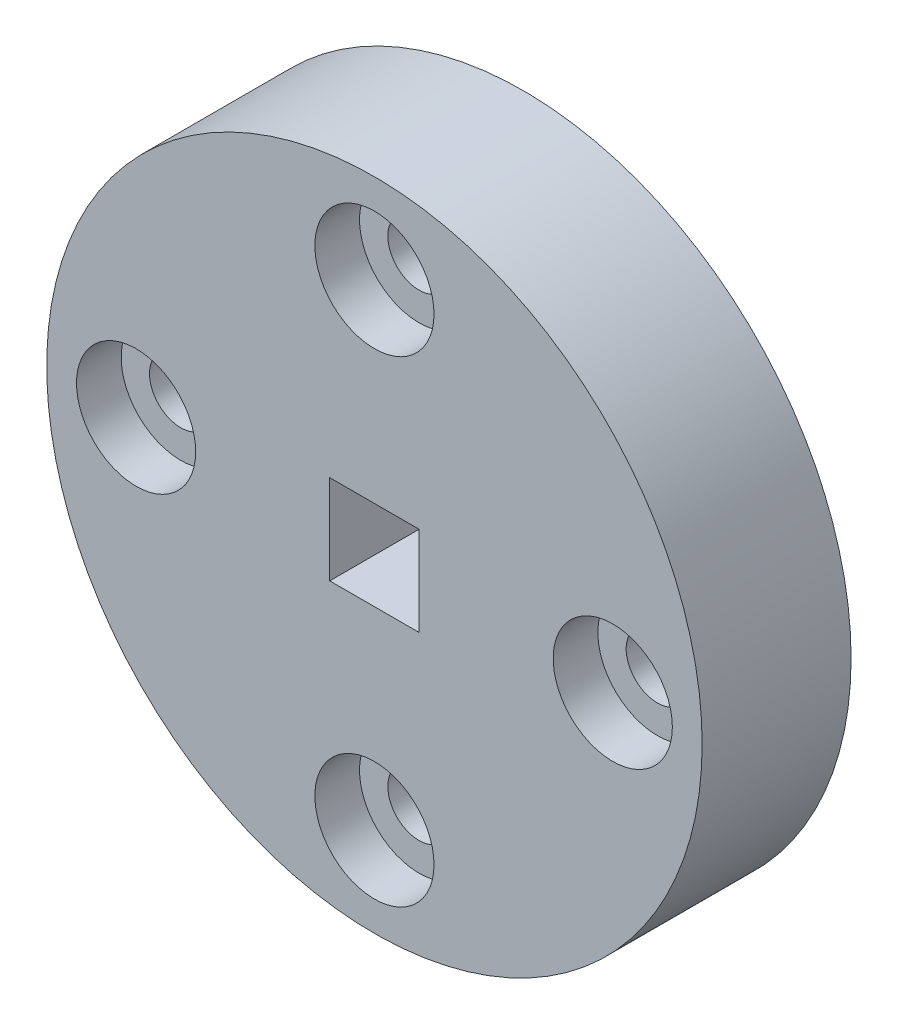
ISO-10303-21;
HEADER;
FILE_DESCRIPTION(('STEP AP214'),'2;1');
FILE_NAME('part.step','',(''),(''),'','','');
FILE_SCHEMA(('AUTOMOTIVE_DESIGN { 1 0 10303 214 1 1 1 1 }'));
ENDSEC;
DATA;
#1=APPLICATION_CONTEXT('core data for automotive mechanical design processes');
#2=APPLICATION_PROTOCOL_DEFINITION('international standard','automotive_design',2000,#1);
#3=PRODUCT_CONTEXT('',#1,'mechanical');
#4=PRODUCT('Part','Part','',(#3));
#5=PRODUCT_RELATED_PRODUCT_CATEGORY('part','',(#4));
#6=PRODUCT_DEFINITION_FORMATION('','',#4);
#7=PRODUCT_DEFINITION_CONTEXT('part definition',#1,'design');
#8=PRODUCT_DEFINITION('design','',#6,#7);
#9=PRODUCT_DEFINITION_SHAPE('','',#8);
#10=(LENGTH_UNIT() NAMED_UNIT(*) SI_UNIT(.MILLI.,.METRE.));
#11=(NAMED_UNIT(*) PLANE_ANGLE_UNIT() SI_UNIT($,.RADIAN.));
#12=(NAMED_UNIT(*) SI_UNIT($,.STERADIAN.) SOLID_ANGLE_UNIT());
#13=UNCERTAINTY_MEASURE_WITH_UNIT(LENGTH_MEASURE(1.E-05),#10,'distance_accuracy_value','');
#14=(GEOMETRIC_REPRESENTATION_CONTEXT(3) GLOBAL_UNCERTAINTY_ASSIGNED_CONTEXT((#13)) GLOBAL_UNIT_ASSIGNED_CONTEXT((#10,
#11,#12)) REPRESENTATION_CONTEXT('',''));
#15=CARTESIAN_POINT('',(0.,0.,0.));
#16=DIRECTION('',(0.,0.,1.));
#17=DIRECTION('',(1.,0.,0.));
#18=AXIS2_PLACEMENT_3D('',#15,#16,#17);
#19=CARTESIAN_POINT('',(5.01808960703953E-07,4.98051479615527E-07,5.));
#20=DIRECTION('',(0.,0.,1.));
#21=DIRECTION('',(1.,0.,0.));
#22=AXIS2_PLACEMENT_3D('',#19,#20,#21);
#23=PLANE('',#22);
#24=CARTESIAN_POINT('',(8.00000049700206,4.97733507187625E-07,5.));
#25=DIRECTION('',(0.,0.,1.));
#26=DIRECTION('',(1.,0.,0.));
#27=AXIS2_PLACEMENT_3D('',#24,#25,#26);
#28=CIRCLE('',#27,2.);
#29=CARTESIAN_POINT('',(10.0000004970021,4.97733507187625E-07,5.));
#30=VERTEX_POINT('',#29);
#31=EDGE_CURVE('E108',#30,#30,#28,.T.);
#32=ORIENTED_EDGE('',*,*,#31,.F.);
#33=EDGE_LOOP('',(#32));
#34=FACE_BOUND('',#33,.T.);
#35=CARTESIAN_POINT('',(4.97002383692546E-07,-7.99999950226649,5.));
#36=DIRECTION('',(0.,0.,1.));
#37=DIRECTION('',(1.,0.,0.));
#38=AXIS2_PLACEMENT_3D('',#35,#36,#37);
#39=CIRCLE('',#38,2.);
#40=CARTESIAN_POINT('',(2.00000049700238,-7.99999950226649,5.));
#41=VERTEX_POINT('',#40);
#42=EDGE_CURVE('E114',#41,#41,#39,.T.);
#43=ORIENTED_EDGE('',*,*,#42,.F.);
#44=EDGE_LOOP('',(#43));
#45=FACE_BOUND('',#44,.T.);
#46=CARTESIAN_POINT('',(-7.99999950226596,4.97733507187625E-07,5.));
#47=DIRECTION('',(0.,0.,1.));
#48=DIRECTION('',(1.,0.,0.));
#49=AXIS2_PLACEMENT_3D('',#46,#47,#48);
#50=CIRCLE('',#49,2.);
#51=CARTESIAN_POINT('',(-5.99999950226596,4.97733507187625E-07,5.));
#52=VERTEX_POINT('',#51);
#53=EDGE_CURVE('E120',#52,#52,#50,.T.);
#54=ORIENTED_EDGE('',*,*,#53,.F.);
#55=EDGE_LOOP('',(#54));
#56=FACE_BOUND('',#55,.T.);
#57=CARTESIAN_POINT('',(4.97002383692546E-07,8.0000004977335,5.));
#58=DIRECTION('',(0.,0.,1.));
#59=DIRECTION('',(1.,0.,0.));
#60=AXIS2_PLACEMENT_3D('',#57,#58,#59);
#61=CIRCLE('',#60,2.);
#62=CARTESIAN_POINT('',(2.00000049700238,8.0000004977335,5.));
#63=VERTEX_POINT('',#62);
#64=EDGE_CURVE('E82',#63,#63,#61,.T.);
#65=ORIENTED_EDGE('',*,*,#64,.F.);
#66=EDGE_LOOP('',(#65));
#67=FACE_BOUND('',#66,.T.);
#68=CARTESIAN_POINT('',(5.01808960703953E-07,4.98051479615527E-07,5.));
#69=DIRECTION('',(0.,0.,1.));
#70=DIRECTION('',(1.,0.,0.));
#71=AXIS2_PLACEMENT_3D('',#68,#69,#70);
#72=CIRCLE('',#71,11.0000000000275);
#73=CARTESIAN_POINT('',(11.0000005018364,4.98051479615527E-07,5.));
#74=VERTEX_POINT('',#73);
#75=EDGE_CURVE('E142',#74,#74,#72,.T.);
#76=ORIENTED_EDGE('',*,*,#75,.T.);
#77=EDGE_LOOP('',(#76));
#78=FACE_BOUND('',#77,.T.);
#79=DIRECTION('',(1.,0.,0.));
#80=VECTOR('',#79,1.);
#81=CARTESIAN_POINT('',(-1.5,-1.5,5.));
#82=LINE('',#81,#80);
#83=CARTESIAN_POINT('',(-1.5,-1.5,5.));
#84=VERTEX_POINT('',#83);
#85=CARTESIAN_POINT('',(1.5,-1.5,5.));
#86=VERTEX_POINT('',#85);
#87=EDGE_CURVE('E95',#84,#86,#82,.T.);
#88=ORIENTED_EDGE('',*,*,#87,.F.);
#89=DIRECTION('',(0.,1.,0.));
#90=VECTOR('',#89,1.);
#91=CARTESIAN_POINT('',(-1.5,-1.5,5.));
#92=LINE('',#91,#90);
#93=CARTESIAN_POINT('',(-1.5,1.5,5.));
#94=VERTEX_POINT('',#93);
#95=EDGE_CURVE('E52',#84,#94,#92,.T.);
#96=ORIENTED_EDGE('',*,*,#95,.T.);
#97=DIRECTION('',(1.,0.,0.));
#98=VECTOR('',#97,1.);
#99=CARTESIAN_POINT('',(-1.5,1.5,5.));
#100=LINE('',#99,#98);
#101=CARTESIAN_POINT('',(1.5,1.5,5.));
#102=VERTEX_POINT('',#101);
#103=EDGE_CURVE('E86',#94,#102,#100,.T.);
#104=ORIENTED_EDGE('',*,*,#103,.T.);
#105=DIRECTION('',(0.,1.,0.));
#106=VECTOR('',#105,1.);
#107=CARTESIAN_POINT('',(1.5,-1.5,5.));
#108=LINE('',#107,#106);
#109=EDGE_CURVE('E92',#86,#102,#108,.T.);
#110=ORIENTED_EDGE('',*,*,#109,.F.);
#111=EDGE_LOOP('',(#88,#96,#104,#110));
#112=FACE_BOUND('',#111,.T.);
#113=ADVANCED_FACE('F37',(#34,#45,#56,#67,#78,#112),#23,.T.);
#114=CARTESIAN_POINT('',(5.01808960703953E-07,4.98051479615527E-07,0.));
#115=DIRECTION('',(0.,0.,1.));
#116=DIRECTION('',(1.,0.,0.));
#117=AXIS2_PLACEMENT_3D('',#114,#115,#116);
#118=PLANE('',#117);
#119=CARTESIAN_POINT('',(4.97002383692546E-07,8.0000004977335,0.));
#120=DIRECTION('',(0.,0.,1.));
#121=DIRECTION('',(1.,0.,0.));
#122=AXIS2_PLACEMENT_3D('',#119,#120,#121);
#123=CIRCLE('',#122,1.05);
#124=CARTESIAN_POINT('',(1.05000049700239,8.0000004977335,0.));
#125=VERTEX_POINT('',#124);
#126=EDGE_CURVE('E128',#125,#125,#123,.T.);
#127=ORIENTED_EDGE('',*,*,#126,.T.);
#128=EDGE_LOOP('',(#127));
#129=FACE_BOUND('',#128,.T.);
#130=CARTESIAN_POINT('',(8.00000049700206,4.97733507187625E-07,0.));
#131=DIRECTION('',(0.,0.,1.));
#132=DIRECTION('',(1.,0.,0.));
#133=AXIS2_PLACEMENT_3D('',#130,#131,#132);
#134=CIRCLE('',#133,1.05);
#135=CARTESIAN_POINT('',(9.05000049700205,4.97733507187625E-07,0.));
#136=VERTEX_POINT('',#135);
#137=EDGE_CURVE('E131',#136,#136,#134,.T.);
#138=ORIENTED_EDGE('',*,*,#137,.T.);
#139=EDGE_LOOP('',(#138));
#140=FACE_BOUND('',#139,.T.);
#141=CARTESIAN_POINT('',(-7.99999950226596,4.97733507187625E-07,0.));
#142=DIRECTION('',(0.,0.,1.));
#143=DIRECTION('',(1.,0.,0.));
#144=AXIS2_PLACEMENT_3D('',#141,#142,#143);
#145=CIRCLE('',#144,1.05);
#146=CARTESIAN_POINT('',(-6.94999950226596,4.97733507187625E-07,0.));
#147=VERTEX_POINT('',#146);
#148=EDGE_CURVE('E135',#147,#147,#145,.T.);
#149=ORIENTED_EDGE('',*,*,#148,.T.);
#150=EDGE_LOOP('',(#149));
#151=FACE_BOUND('',#150,.T.);
#152=CARTESIAN_POINT('',(4.97002383692546E-07,-7.99999950226649,0.));
#153=DIRECTION('',(0.,0.,1.));
#154=DIRECTION('',(1.,0.,0.));
#155=AXIS2_PLACEMENT_3D('',#152,#153,#154);
#156=CIRCLE('',#155,1.05);
#157=CARTESIAN_POINT('',(1.05000049700239,-7.99999950226649,0.));
#158=VERTEX_POINT('',#157);
#159=EDGE_CURVE('E138',#158,#158,#156,.T.);
#160=ORIENTED_EDGE('',*,*,#159,.T.);
#161=EDGE_LOOP('',(#160));
#162=FACE_BOUND('',#161,.T.);
#163=CARTESIAN_POINT('',(6.85708212216571E-09,5.50349579710868E-07,0.));
#164=DIRECTION('',(0.,0.,1.));
#165=DIRECTION('',(1.,0.,0.));
#166=AXIS2_PLACEMENT_3D('',#163,#164,#165);
#167=CIRCLE('',#166,11.0000004977346);
#168=CARTESIAN_POINT('',(11.0000005045917,5.50349579710868E-07,0.));
#169=VERTEX_POINT('',#168);
#170=EDGE_CURVE('E141',#169,#169,#167,.T.);
#171=ORIENTED_EDGE('',*,*,#170,.F.);
#172=EDGE_LOOP('',(#171));
#173=FACE_BOUND('',#172,.T.);
#174=DIRECTION('',(0.,1.,0.));
#175=VECTOR('',#174,1.);
#176=CARTESIAN_POINT('',(-1.5,4.98051479615527E-07,0.));
#177=LINE('',#176,#175);
#178=CARTESIAN_POINT('',(-1.5,-1.5,0.));
#179=VERTEX_POINT('',#178);
#180=CARTESIAN_POINT('',(-1.5,1.5,0.));
#181=VERTEX_POINT('',#180);
#182=EDGE_CURVE('E11',#179,#181,#177,.T.);
#183=ORIENTED_EDGE('',*,*,#182,.F.);
#184=DIRECTION('',(1.,0.,0.));
#185=VECTOR('',#184,1.);
#186=CARTESIAN_POINT('',(5.01808960703953E-07,-1.5,0.));
#187=LINE('',#186,#185);
#188=CARTESIAN_POINT('',(1.5,-1.5,0.));
#189=VERTEX_POINT('',#188);
#190=EDGE_CURVE('E145',#179,#189,#187,.T.);
#191=ORIENTED_EDGE('',*,*,#190,.T.);
#192=DIRECTION('',(0.,1.,0.));
#193=VECTOR('',#192,1.);
#194=CARTESIAN_POINT('',(1.5,4.98051479615527E-07,0.));
#195=LINE('',#194,#193);
#196=CARTESIAN_POINT('',(1.5,1.5,0.));
#197=VERTEX_POINT('',#196);
#198=EDGE_CURVE('E160',#189,#197,#195,.T.);
#199=ORIENTED_EDGE('',*,*,#198,.T.);
#200=DIRECTION('',(1.,0.,0.));
#201=VECTOR('',#200,1.);
#202=CARTESIAN_POINT('',(5.01808960703953E-07,1.5,0.));
#203=LINE('',#202,#201);
#204=EDGE_CURVE('E45',#181,#197,#203,.T.);
#205=ORIENTED_EDGE('',*,*,#204,.F.);
#206=EDGE_LOOP('',(#183,#191,#199,#205));
#207=FACE_BOUND('',#206,.T.);
#208=ADVANCED_FACE('F165',(#129,#140,#151,#162,#173,#207),#118,.F.);
#209=CARTESIAN_POINT('',(4.97002383692546E-07,-7.99999950226649,5.));
#210=DIRECTION('',(0.,0.,-1.));
#211=DIRECTION('',(-1.,0.,0.));
#212=AXIS2_PLACEMENT_3D('',#209,#210,#211);
#213=CYLINDRICAL_SURFACE('',#212,1.05);
#214=ORIENTED_EDGE('',*,*,#159,.F.);
#215=EDGE_LOOP('',(#214));
#216=FACE_BOUND('',#215,.T.);
#217=CARTESIAN_POINT('',(4.97002383692546E-07,-7.99999950226649,3.5));
#218=DIRECTION('',(0.,0.,1.));
#219=DIRECTION('',(1.,0.,0.));
#220=AXIS2_PLACEMENT_3D('',#217,#218,#219);
#221=CIRCLE('',#220,1.05);
#222=CARTESIAN_POINT('',(1.05000049700239,-7.99999950226649,3.5));
#223=VERTEX_POINT('',#222);
#224=EDGE_CURVE('E132',#223,#223,#221,.T.);
#225=ORIENTED_EDGE('',*,*,#224,.T.);
#226=EDGE_LOOP('',(#225));
#227=FACE_BOUND('',#226,.T.);
#228=ADVANCED_FACE('F179',(#216,#227),#213,.F.);
#229=CARTESIAN_POINT('',(-7.99999950226596,4.97733507187625E-07,5.));
#230=DIRECTION('',(0.,0.,-1.));
#231=DIRECTION('',(-1.,0.,0.));
#232=AXIS2_PLACEMENT_3D('',#229,#230,#231);
#233=CYLINDRICAL_SURFACE('',#232,1.05);
#234=ORIENTED_EDGE('',*,*,#148,.F.);
#235=EDGE_LOOP('',(#234));
#236=FACE_BOUND('',#235,.T.);
#237=CARTESIAN_POINT('',(-7.99999950226596,4.97733507187625E-07,3.5));
#238=DIRECTION('',(0.,0.,1.));
#239=DIRECTION('',(1.,0.,0.));
#240=AXIS2_PLACEMENT_3D('',#237,#238,#239);
#241=CIRCLE('',#240,1.05);
#242=CARTESIAN_POINT('',(-6.94999950226596,4.97733507187625E-07,3.5));
#243=VERTEX_POINT('',#242);
#244=EDGE_CURVE('E153',#243,#243,#241,.T.);
#245=ORIENTED_EDGE('',*,*,#244,.T.);
#246=EDGE_LOOP('',(#245));
#247=FACE_BOUND('',#246,.T.);
#248=ADVANCED_FACE('F186',(#236,#247),#233,.F.);
#249=CARTESIAN_POINT('',(8.00000049700206,4.97733507187625E-07,5.));
#250=DIRECTION('',(0.,0.,-1.));
#251=DIRECTION('',(-1.,0.,0.));
#252=AXIS2_PLACEMENT_3D('',#249,#250,#251);
#253=CYLINDRICAL_SURFACE('',#252,1.05);
#254=ORIENTED_EDGE('',*,*,#137,.F.);
#255=EDGE_LOOP('',(#254));
#256=FACE_BOUND('',#255,.T.);
#257=CARTESIAN_POINT('',(8.00000049700206,4.97733507187625E-07,3.5));
#258=DIRECTION('',(0.,0.,1.));
#259=DIRECTION('',(1.,0.,0.));
#260=AXIS2_PLACEMENT_3D('',#257,#258,#259);
#261=CIRCLE('',#260,1.05);
#262=CARTESIAN_POINT('',(9.05000049700205,4.97733507187625E-07,3.5));
#263=VERTEX_POINT('',#262);
#264=EDGE_CURVE('E150',#263,#263,#261,.T.);
#265=ORIENTED_EDGE('',*,*,#264,.T.);
#266=EDGE_LOOP('',(#265));
#267=FACE_BOUND('',#266,.T.);
#268=ADVANCED_FACE('F190',(#256,#267),#253,.F.);
#269=CARTESIAN_POINT('',(4.97002383692546E-07,8.0000004977335,5.));
#270=DIRECTION('',(0.,0.,-1.));
#271=DIRECTION('',(-1.,0.,0.));
#272=AXIS2_PLACEMENT_3D('',#269,#270,#271);
#273=CYLINDRICAL_SURFACE('',#272,1.05);
#274=ORIENTED_EDGE('',*,*,#126,.F.);
#275=EDGE_LOOP('',(#274));
#276=FACE_BOUND('',#275,.T.);
#277=CARTESIAN_POINT('',(4.97002383692546E-07,8.0000004977335,3.5));
#278=DIRECTION('',(0.,0.,1.));
#279=DIRECTION('',(1.,0.,0.));
#280=AXIS2_PLACEMENT_3D('',#277,#278,#279);
#281=CIRCLE('',#280,1.05);
#282=CARTESIAN_POINT('',(1.05000049700239,8.0000004977335,3.5));
#283=VERTEX_POINT('',#282);
#284=EDGE_CURVE('E107',#283,#283,#281,.T.);
#285=ORIENTED_EDGE('',*,*,#284,.T.);
#286=EDGE_LOOP('',(#285));
#287=FACE_BOUND('',#286,.T.);
#288=ADVANCED_FACE('F194',(#276,#287),#273,.F.);
#289=CARTESIAN_POINT('',(6.85708212216571E-09,5.50349579710868E-07,5.));
#290=DIRECTION('',(0.,0.,-1.));
#291=DIRECTION('',(-1.,0.,0.));
#292=AXIS2_PLACEMENT_3D('',#289,#290,#291);
#293=CYLINDRICAL_SURFACE('',#292,11.0000004977346);
#294=ORIENTED_EDGE('',*,*,#170,.T.);
#295=EDGE_LOOP('',(#294));
#296=FACE_BOUND('',#295,.T.);
#297=ORIENTED_EDGE('',*,*,#75,.F.);
#298=EDGE_LOOP('',(#297));
#299=FACE_BOUND('',#298,.T.);
#300=ADVANCED_FACE('F39',(#296,#299),#293,.T.);
#301=CARTESIAN_POINT('',(4.97002383692546E-07,8.0000004977335,3.5));
#302=DIRECTION('',(0.,0.,1.));
#303=DIRECTION('',(1.,0.,0.));
#304=AXIS2_PLACEMENT_3D('',#301,#302,#303);
#305=CYLINDRICAL_SURFACE('',#304,2.);
#306=CARTESIAN_POINT('',(4.97002383692546E-07,8.0000004977335,3.5));
#307=DIRECTION('',(0.,0.,1.));
#308=DIRECTION('',(1.,0.,0.));
#309=AXIS2_PLACEMENT_3D('',#306,#307,#308);
#310=CIRCLE('',#309,2.);
#311=CARTESIAN_POINT('',(2.00000049700238,8.0000004977335,3.5));
#312=VERTEX_POINT('',#311);
#313=EDGE_CURVE('E123',#312,#312,#310,.T.);
#314=ORIENTED_EDGE('',*,*,#313,.F.);
#315=EDGE_LOOP('',(#314));
#316=FACE_BOUND('',#315,.T.);
#317=ORIENTED_EDGE('',*,*,#64,.T.);
#318=EDGE_LOOP('',(#317));
#319=FACE_BOUND('',#318,.T.);
#320=ADVANCED_FACE('F199',(#316,#319),#305,.F.);
#321=CARTESIAN_POINT('',(4.97002383692546E-07,8.0000004977335,3.5));
#322=DIRECTION('',(0.,0.,1.));
#323=DIRECTION('',(1.,0.,0.));
#324=AXIS2_PLACEMENT_3D('',#321,#322,#323);
#325=PLANE('',#324);
#326=ORIENTED_EDGE('',*,*,#284,.F.);
#327=EDGE_LOOP('',(#326));
#328=FACE_BOUND('',#327,.T.);
#329=ORIENTED_EDGE('',*,*,#313,.T.);
#330=EDGE_LOOP('',(#329));
#331=FACE_BOUND('',#330,.T.);
#332=ADVANCED_FACE('F202',(#328,#331),#325,.T.);
#333=CARTESIAN_POINT('',(8.00000049700206,4.97733507187625E-07,3.5));
#334=DIRECTION('',(0.,0.,1.));
#335=DIRECTION('',(1.,0.,0.));
#336=AXIS2_PLACEMENT_3D('',#333,#334,#335);
#337=CYLINDRICAL_SURFACE('',#336,2.);
#338=CARTESIAN_POINT('',(8.00000049700206,4.97733507187625E-07,3.5));
#339=DIRECTION('',(0.,0.,1.));
#340=DIRECTION('',(1.,0.,0.));
#341=AXIS2_PLACEMENT_3D('',#338,#339,#340);
#342=CIRCLE('',#341,2.);
#343=CARTESIAN_POINT('',(10.0000004970021,4.97733507187625E-07,3.5));
#344=VERTEX_POINT('',#343);
#345=EDGE_CURVE('E104',#344,#344,#342,.T.);
#346=ORIENTED_EDGE('',*,*,#345,.F.);
#347=EDGE_LOOP('',(#346));
#348=FACE_BOUND('',#347,.T.);
#349=ORIENTED_EDGE('',*,*,#31,.T.);
#350=EDGE_LOOP('',(#349));
#351=FACE_BOUND('',#350,.T.);
#352=ADVANCED_FACE('F206',(#348,#351),#337,.F.);
#353=CARTESIAN_POINT('',(8.00000049700206,4.97733507187625E-07,3.5));
#354=DIRECTION('',(0.,0.,1.));
#355=DIRECTION('',(1.,0.,0.));
#356=AXIS2_PLACEMENT_3D('',#353,#354,#355);
#357=PLANE('',#356);
#358=ORIENTED_EDGE('',*,*,#264,.F.);
#359=EDGE_LOOP('',(#358));
#360=FACE_BOUND('',#359,.T.);
#361=ORIENTED_EDGE('',*,*,#345,.T.);
#362=EDGE_LOOP('',(#361));
#363=FACE_BOUND('',#362,.T.);
#364=ADVANCED_FACE('F212',(#360,#363),#357,.T.);
#365=CARTESIAN_POINT('',(-7.99999950226596,4.97733507187625E-07,3.5));
#366=DIRECTION('',(0.,0.,1.));
#367=DIRECTION('',(1.,0.,0.));
#368=AXIS2_PLACEMENT_3D('',#365,#366,#367);
#369=CYLINDRICAL_SURFACE('',#368,2.);
#370=CARTESIAN_POINT('',(-7.99999950226596,4.97733507187625E-07,3.5));
#371=DIRECTION('',(0.,0.,1.));
#372=DIRECTION('',(1.,0.,0.));
#373=AXIS2_PLACEMENT_3D('',#370,#371,#372);
#374=CIRCLE('',#373,2.);
#375=CARTESIAN_POINT('',(-5.99999950226596,4.97733507187625E-07,3.5));
#376=VERTEX_POINT('',#375);
#377=EDGE_CURVE('E117',#376,#376,#374,.T.);
#378=ORIENTED_EDGE('',*,*,#377,.F.);
#379=EDGE_LOOP('',(#378));
#380=FACE_BOUND('',#379,.T.);
#381=ORIENTED_EDGE('',*,*,#53,.T.);
#382=EDGE_LOOP('',(#381));
#383=FACE_BOUND('',#382,.T.);
#384=ADVANCED_FACE('F208',(#380,#383),#369,.F.);
#385=CARTESIAN_POINT('',(-7.99999950226596,4.97733507187625E-07,3.5));
#386=DIRECTION('',(0.,0.,1.));
#387=DIRECTION('',(1.,0.,0.));
#388=AXIS2_PLACEMENT_3D('',#385,#386,#387);
#389=PLANE('',#388);
#390=ORIENTED_EDGE('',*,*,#244,.F.);
#391=EDGE_LOOP('',(#390));
#392=FACE_BOUND('',#391,.T.);
#393=ORIENTED_EDGE('',*,*,#377,.T.);
#394=EDGE_LOOP('',(#393));
#395=FACE_BOUND('',#394,.T.);
#396=ADVANCED_FACE('F211',(#392,#395),#389,.T.);
#397=CARTESIAN_POINT('',(4.97002383692546E-07,-7.99999950226649,3.5));
#398=DIRECTION('',(0.,0.,1.));
#399=DIRECTION('',(1.,0.,0.));
#400=AXIS2_PLACEMENT_3D('',#397,#398,#399);
#401=CYLINDRICAL_SURFACE('',#400,2.);
#402=CARTESIAN_POINT('',(4.97002383692546E-07,-7.99999950226649,3.5));
#403=DIRECTION('',(0.,0.,1.));
#404=DIRECTION('',(1.,0.,0.));
#405=AXIS2_PLACEMENT_3D('',#402,#403,#404);
#406=CIRCLE('',#405,2.);
#407=CARTESIAN_POINT('',(2.00000049700238,-7.99999950226649,3.5));
#408=VERTEX_POINT('',#407);
#409=EDGE_CURVE('E111',#408,#408,#406,.T.);
#410=ORIENTED_EDGE('',*,*,#409,.F.);
#411=EDGE_LOOP('',(#410));
#412=FACE_BOUND('',#411,.T.);
#413=ORIENTED_EDGE('',*,*,#42,.T.);
#414=EDGE_LOOP('',(#413));
#415=FACE_BOUND('',#414,.T.);
#416=ADVANCED_FACE('F216',(#412,#415),#401,.F.);
#417=CARTESIAN_POINT('',(4.97002383692546E-07,-7.99999950226649,3.5));
#418=DIRECTION('',(0.,0.,1.));
#419=DIRECTION('',(1.,0.,0.));
#420=AXIS2_PLACEMENT_3D('',#417,#418,#419);
#421=PLANE('',#420);
#422=ORIENTED_EDGE('',*,*,#224,.F.);
#423=EDGE_LOOP('',(#422));
#424=FACE_BOUND('',#423,.T.);
#425=ORIENTED_EDGE('',*,*,#409,.T.);
#426=EDGE_LOOP('',(#425));
#427=FACE_BOUND('',#426,.T.);
#428=ADVANCED_FACE('F220',(#424,#427),#421,.T.);
#429=CARTESIAN_POINT('',(-1.5,-1.5,-5.));
#430=DIRECTION('',(1.,0.,0.));
#431=DIRECTION('',(0.,0.,-1.));
#432=AXIS2_PLACEMENT_3D('',#429,#430,#431);
#433=PLANE('',#432);
#434=ORIENTED_EDGE('',*,*,#182,.T.);
#435=DIRECTION('',(0.,0.,1.));
#436=VECTOR('',#435,1.);
#437=CARTESIAN_POINT('',(-1.5,1.5,-5.));
#438=LINE('',#437,#436);
#439=EDGE_CURVE('E76',#181,#94,#438,.T.);
#440=ORIENTED_EDGE('',*,*,#439,.T.);
#441=ORIENTED_EDGE('',*,*,#95,.F.);
#442=DIRECTION('',(0.,0.,1.));
#443=VECTOR('',#442,1.);
#444=CARTESIAN_POINT('',(-1.5,-1.5,-5.));
#445=LINE('',#444,#443);
#446=EDGE_CURVE('E100',#179,#84,#445,.T.);
#447=ORIENTED_EDGE('',*,*,#446,.F.);
#448=EDGE_LOOP('',(#434,#440,#441,#447));
#449=FACE_BOUND('',#448,.T.);
#450=ADVANCED_FACE('F78',(#449),#433,.T.);
#451=CARTESIAN_POINT('',(-1.5,1.5,-5.));
#452=DIRECTION('',(0.,-1.,0.));
#453=DIRECTION('',(0.,0.,-1.));
#454=AXIS2_PLACEMENT_3D('',#451,#452,#453);
#455=PLANE('',#454);
#456=ORIENTED_EDGE('',*,*,#204,.T.);
#457=DIRECTION('',(0.,0.,1.));
#458=VECTOR('',#457,1.);
#459=CARTESIAN_POINT('',(1.5,1.5,-5.));
#460=LINE('',#459,#458);
#461=EDGE_CURVE('E83',#197,#102,#460,.T.);
#462=ORIENTED_EDGE('',*,*,#461,.T.);
#463=ORIENTED_EDGE('',*,*,#103,.F.);
#464=ORIENTED_EDGE('',*,*,#439,.F.);
#465=EDGE_LOOP('',(#456,#462,#463,#464));
#466=FACE_BOUND('',#465,.T.);
#467=ADVANCED_FACE('F87',(#466),#455,.T.);
#468=CARTESIAN_POINT('',(1.5,-1.5,-5.));
#469=DIRECTION('',(1.,0.,0.));
#470=DIRECTION('',(0.,0.,-1.));
#471=AXIS2_PLACEMENT_3D('',#468,#469,#470);
#472=PLANE('',#471);
#473=DIRECTION('',(0.,0.,1.));
#474=VECTOR('',#473,1.);
#475=CARTESIAN_POINT('',(1.5,-1.5,-5.));
#476=LINE('',#475,#474);
#477=EDGE_CURVE('E60',#189,#86,#476,.T.);
#478=ORIENTED_EDGE('',*,*,#477,.T.);
#479=ORIENTED_EDGE('',*,*,#109,.T.);
#480=ORIENTED_EDGE('',*,*,#461,.F.);
#481=ORIENTED_EDGE('',*,*,#198,.F.);
#482=EDGE_LOOP('',(#478,#479,#480,#481));
#483=FACE_BOUND('',#482,.T.);
#484=ADVANCED_FACE('F164',(#483),#472,.F.);
#485=CARTESIAN_POINT('',(-1.5,-1.5,-5.));
#486=DIRECTION('',(0.,-1.,0.));
#487=DIRECTION('',(0.,0.,-1.));
#488=AXIS2_PLACEMENT_3D('',#485,#486,#487);
#489=PLANE('',#488);
#490=ORIENTED_EDGE('',*,*,#446,.T.);
#491=ORIENTED_EDGE('',*,*,#87,.T.);
#492=ORIENTED_EDGE('',*,*,#477,.F.);
#493=ORIENTED_EDGE('',*,*,#190,.F.);
#494=EDGE_LOOP('',(#490,#491,#492,#493));
#495=FACE_BOUND('',#494,.T.);
#496=ADVANCED_FACE('F166',(#495),#489,.F.);
#497=CLOSED_SHELL('',(#113,#208,#228,#248,#268,#288,#300,#320,#332,#352,#364,#384,#396,#416,
#428,#450,#467,#484,#496));
#498=MANIFOLD_SOLID_BREP('B2',#497);
#499=ADVANCED_BREP_SHAPE_REPRESENTATION('',(#18,#498),#14);
#500=SHAPE_DEFINITION_REPRESENTATION(#9,#499);
ENDSEC;
END-ISO-10303-21;
